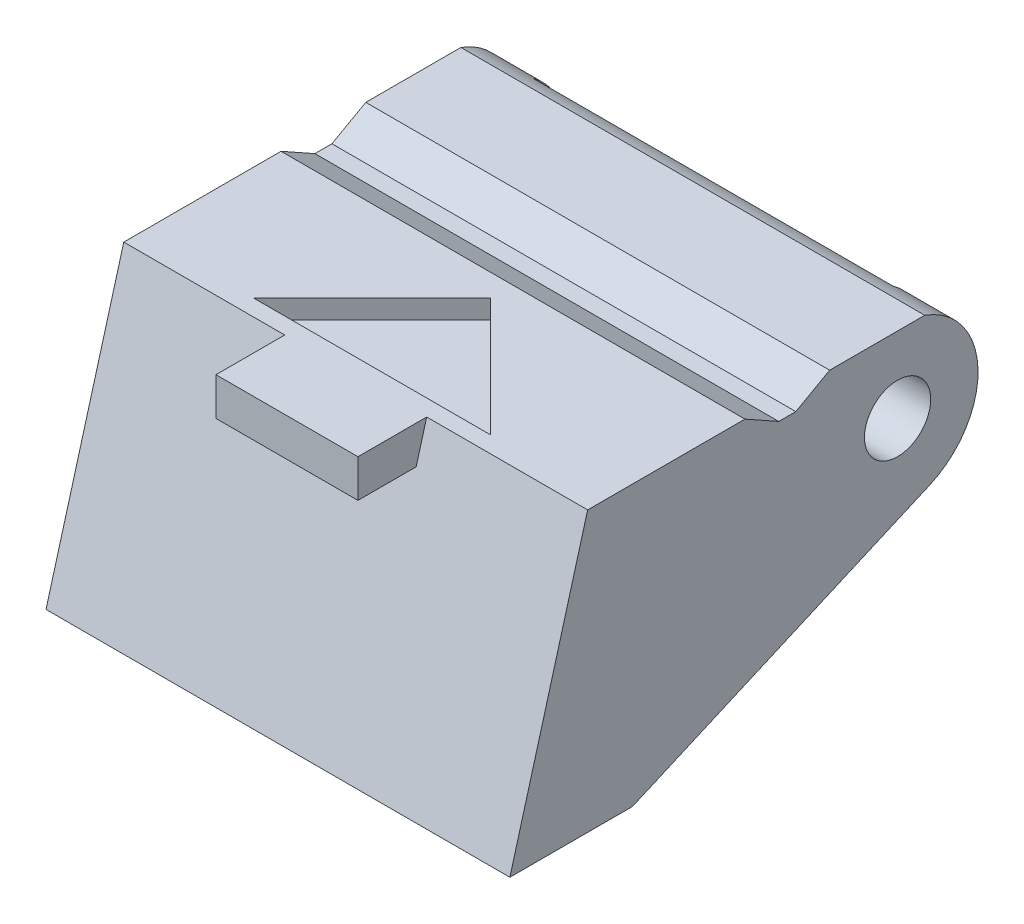
ISO-10303-21;
HEADER;
FILE_DESCRIPTION(('STEP AP214'),'2;1');
FILE_NAME('part.step','',(''),(''),'','','');
FILE_SCHEMA(('AUTOMOTIVE_DESIGN { 1 0 10303 214 1 1 1 1 }'));
ENDSEC;
DATA;
#1=APPLICATION_CONTEXT('core data for automotive mechanical design processes');
#2=APPLICATION_PROTOCOL_DEFINITION('international standard','automotive_design',2000,#1);
#3=PRODUCT_CONTEXT('',#1,'mechanical');
#4=PRODUCT('Part','Part','',(#3));
#5=PRODUCT_RELATED_PRODUCT_CATEGORY('part','',(#4));
#6=PRODUCT_DEFINITION_FORMATION('','',#4);
#7=PRODUCT_DEFINITION_CONTEXT('part definition',#1,'design');
#8=PRODUCT_DEFINITION('design','',#6,#7);
#9=PRODUCT_DEFINITION_SHAPE('','',#8);
#10=(LENGTH_UNIT() NAMED_UNIT(*) SI_UNIT(.MILLI.,.METRE.));
#11=(NAMED_UNIT(*) PLANE_ANGLE_UNIT() SI_UNIT($,.RADIAN.));
#12=(NAMED_UNIT(*) SI_UNIT($,.STERADIAN.) SOLID_ANGLE_UNIT());
#13=UNCERTAINTY_MEASURE_WITH_UNIT(LENGTH_MEASURE(1.E-05),#10,'distance_accuracy_value','');
#14=(GEOMETRIC_REPRESENTATION_CONTEXT(3) GLOBAL_UNCERTAINTY_ASSIGNED_CONTEXT((#13)) GLOBAL_UNIT_ASSIGNED_CONTEXT((#10,
#11,#12)) REPRESENTATION_CONTEXT('',''));
#15=CARTESIAN_POINT('',(0.,0.,0.));
#16=DIRECTION('',(0.,0.,1.));
#17=DIRECTION('',(1.,0.,0.));
#18=AXIS2_PLACEMENT_3D('',#15,#16,#17);
#19=CARTESIAN_POINT('',(4.9,1.6,-1.7));
#20=DIRECTION('',(0.,-1.,0.));
#21=DIRECTION('',(0.,0.,-1.));
#22=AXIS2_PLACEMENT_3D('',#19,#20,#21);
#23=PLANE('',#22);
#24=DIRECTION('',(0.,0.,1.));
#25=VECTOR('',#24,1.);
#26=CARTESIAN_POINT('',(-4.9,1.6,-1.7));
#27=LINE('',#26,#25);
#28=CARTESIAN_POINT('',(-4.9,1.6,-0.574456264653803));
#29=VERTEX_POINT('',#28);
#30=CARTESIAN_POINT('',(-4.9,1.6,1.435));
#31=VERTEX_POINT('',#30);
#32=EDGE_CURVE('E187',#29,#31,#27,.T.);
#33=ORIENTED_EDGE('',*,*,#32,.T.);
#34=DIRECTION('',(1.,0.,0.));
#35=VECTOR('',#34,1.);
#36=CARTESIAN_POINT('',(-5.,1.6,1.435));
#37=LINE('',#36,#35);
#38=CARTESIAN_POINT('',(4.9,1.6,1.435));
#39=VERTEX_POINT('',#38);
#40=EDGE_CURVE('E292',#31,#39,#37,.T.);
#41=ORIENTED_EDGE('',*,*,#40,.T.);
#42=DIRECTION('',(0.,0.,1.));
#43=VECTOR('',#42,1.);
#44=CARTESIAN_POINT('',(4.9,1.6,-1.7));
#45=LINE('',#44,#43);
#46=CARTESIAN_POINT('',(4.9,1.6,-0.574456264653803));
#47=VERTEX_POINT('',#46);
#48=EDGE_CURVE('E277',#47,#39,#45,.T.);
#49=ORIENTED_EDGE('',*,*,#48,.F.);
#50=DIRECTION('',(-1.,0.,0.));
#51=VECTOR('',#50,1.);
#52=CARTESIAN_POINT('',(4.9,1.6,-0.574456264653803));
#53=LINE('',#52,#51);
#54=EDGE_CURVE('E264',#47,#29,#53,.T.);
#55=ORIENTED_EDGE('',*,*,#54,.T.);
#56=EDGE_LOOP('',(#33,#41,#49,#55));
#57=FACE_BOUND('',#56,.T.);
#58=ADVANCED_FACE('F15',(#57),#23,.F.);
#59=CARTESIAN_POINT('',(4.9,0.,0.));
#60=DIRECTION('',(-1.,0.,0.));
#61=DIRECTION('',(0.,0.,1.));
#62=AXIS2_PLACEMENT_3D('',#59,#60,#61);
#63=CYLINDRICAL_SURFACE('',#62,1.7);
#64=CARTESIAN_POINT('',(3.8,0.,0.));
#65=DIRECTION('',(1.,0.,0.));
#66=DIRECTION('',(0.,0.,-1.));
#67=AXIS2_PLACEMENT_3D('',#64,#65,#66);
#68=CIRCLE('',#67,1.7);
#69=CARTESIAN_POINT('',(3.8,-1.55797498876303,-0.680230794943039));
#70=VERTEX_POINT('',#69);
#71=CARTESIAN_POINT('',(3.8,1.38081445189058,-0.991640786499881));
#72=VERTEX_POINT('',#71);
#73=EDGE_CURVE('E254',#70,#72,#68,.T.);
#74=ORIENTED_EDGE('',*,*,#73,.T.);
#75=DIRECTION('',(-1.,0.,0.));
#76=VECTOR('',#75,1.);
#77=CARTESIAN_POINT('',(3.8,1.38081445189058,-0.991640786499881));
#78=LINE('',#77,#76);
#79=CARTESIAN_POINT('',(-3.8,1.38081445189058,-0.991640786499881));
#80=VERTEX_POINT('',#79);
#81=EDGE_CURVE('E231',#72,#80,#78,.T.);
#82=ORIENTED_EDGE('',*,*,#81,.T.);
#83=CARTESIAN_POINT('',(-3.8,0.,0.));
#84=DIRECTION('',(1.,0.,0.));
#85=DIRECTION('',(0.,0.,-1.));
#86=AXIS2_PLACEMENT_3D('',#83,#84,#85);
#87=CIRCLE('',#86,1.7);
#88=CARTESIAN_POINT('',(-3.8,-1.55797498876303,-0.680230794943039));
#89=VERTEX_POINT('',#88);
#90=EDGE_CURVE('E337',#89,#80,#87,.T.);
#91=ORIENTED_EDGE('',*,*,#90,.F.);
#92=DIRECTION('',(1.,0.,0.));
#93=VECTOR('',#92,1.);
#94=CARTESIAN_POINT('',(-4.9,-1.55797498876303,-0.680230794943039));
#95=LINE('',#94,#93);
#96=CARTESIAN_POINT('',(-4.9,-1.55797498876303,-0.680230794943039));
#97=VERTEX_POINT('',#96);
#98=EDGE_CURVE('E188',#97,#89,#95,.T.);
#99=ORIENTED_EDGE('',*,*,#98,.F.);
#100=CARTESIAN_POINT('',(-4.9,0.,0.));
#101=DIRECTION('',(-1.,0.,0.));
#102=DIRECTION('',(0.,0.,-1.));
#103=AXIS2_PLACEMENT_3D('',#100,#101,#102);
#104=CIRCLE('',#103,1.7);
#105=EDGE_CURVE('E346',#29,#97,#104,.T.);
#106=ORIENTED_EDGE('',*,*,#105,.F.);
#107=ORIENTED_EDGE('',*,*,#54,.F.);
#108=CARTESIAN_POINT('',(4.9,0.,0.));
#109=DIRECTION('',(-1.,0.,0.));
#110=DIRECTION('',(0.,0.,-1.));
#111=AXIS2_PLACEMENT_3D('',#108,#109,#110);
#112=CIRCLE('',#111,1.7);
#113=CARTESIAN_POINT('',(4.9,-1.55797498876303,-0.680230794943039));
#114=VERTEX_POINT('',#113);
#115=EDGE_CURVE('E266',#47,#114,#112,.T.);
#116=ORIENTED_EDGE('',*,*,#115,.T.);
#117=DIRECTION('',(-1.,0.,0.));
#118=VECTOR('',#117,1.);
#119=CARTESIAN_POINT('',(4.9,-1.55797498876303,-0.680230794943039));
#120=LINE('',#119,#118);
#121=EDGE_CURVE('E274',#114,#70,#120,.T.);
#122=ORIENTED_EDGE('',*,*,#121,.T.);
#123=EDGE_LOOP('',(#74,#82,#91,#99,#106,#107,#116,#122));
#124=FACE_BOUND('',#123,.T.);
#125=ADVANCED_FACE('F386',(#124),#63,.T.);
#126=CARTESIAN_POINT('',(3.8,0.799999999999999,5.94));
#127=DIRECTION('',(0.,-1.,0.));
#128=DIRECTION('',(0.,0.,-1.));
#129=AXIS2_PLACEMENT_3D('',#126,#127,#128);
#130=PLANE('',#129);
#131=DIRECTION('',(-1.,0.,0.));
#132=VECTOR('',#131,1.);
#133=CARTESIAN_POINT('',(3.8,0.799999999999999,5.94));
#134=LINE('',#133,#132);
#135=CARTESIAN_POINT('',(3.8,0.799999999999999,5.94));
#136=VERTEX_POINT('',#135);
#137=CARTESIAN_POINT('',(-3.8,0.799999999999999,5.94));
#138=VERTEX_POINT('',#137);
#139=EDGE_CURVE('E262',#136,#138,#134,.T.);
#140=ORIENTED_EDGE('',*,*,#139,.T.);
#141=DIRECTION('',(0.,0.,1.));
#142=VECTOR('',#141,1.);
#143=CARTESIAN_POINT('',(-3.8,0.799999999999999,5.94));
#144=LINE('',#143,#142);
#145=CARTESIAN_POINT('',(-3.8,0.799999999999999,0.0143593539448927));
#146=VERTEX_POINT('',#145);
#147=EDGE_CURVE('E340',#146,#138,#144,.T.);
#148=ORIENTED_EDGE('',*,*,#147,.F.);
#149=DIRECTION('',(-1.,0.,0.));
#150=VECTOR('',#149,1.);
#151=CARTESIAN_POINT('',(3.8,0.799999999999999,0.0143593539448927));
#152=LINE('',#151,#150);
#153=CARTESIAN_POINT('',(3.8,0.799999999999999,0.0143593539448927));
#154=VERTEX_POINT('',#153);
#155=EDGE_CURVE('E229',#154,#146,#152,.T.);
#156=ORIENTED_EDGE('',*,*,#155,.F.);
#157=DIRECTION('',(0.,0.,1.));
#158=VECTOR('',#157,1.);
#159=CARTESIAN_POINT('',(3.8,0.799999999999999,5.94));
#160=LINE('',#159,#158);
#161=EDGE_CURVE('E256',#154,#136,#160,.T.);
#162=ORIENTED_EDGE('',*,*,#161,.T.);
#163=EDGE_LOOP('',(#140,#148,#156,#162));
#164=FACE_BOUND('',#163,.T.);
#165=ADVANCED_FACE('F392',(#164),#130,.T.);
#166=CARTESIAN_POINT('',(4.9,1.6,-1.7));
#167=DIRECTION('',(-1.,0.,0.));
#168=DIRECTION('',(0.,0.,1.));
#169=AXIS2_PLACEMENT_3D('',#166,#167,#168);
#170=PLANE('',#169);
#171=ORIENTED_EDGE('',*,*,#48,.T.);
#172=DIRECTION('',(0.,-0.488231650079598,0.872714074517281));
#173=VECTOR('',#172,1.);
#174=CARTESIAN_POINT('',(4.9,2.93578159335544,-0.952709598122836));
#175=LINE('',#174,#173);
#176=CARTESIAN_POINT('',(4.9,1.2,2.15));
#177=VERTEX_POINT('',#176);
#178=EDGE_CURVE('E301',#39,#177,#175,.T.);
#179=ORIENTED_EDGE('',*,*,#178,.T.);
#180=DIRECTION('',(0.,0.,1.));
#181=VECTOR('',#180,1.);
#182=CARTESIAN_POINT('',(4.9,1.2,-1.7));
#183=LINE('',#182,#181);
#184=CARTESIAN_POINT('',(4.9,1.2,2.51));
#185=VERTEX_POINT('',#184);
#186=EDGE_CURVE('E289',#177,#185,#183,.T.);
#187=ORIENTED_EDGE('',*,*,#186,.T.);
#188=DIRECTION('',(0.,0.488231650079598,0.872714074517281));
#189=VECTOR('',#188,1.);
#190=CARTESIAN_POINT('',(4.9,-0.498476665797609,-0.526027040113224));
#191=LINE('',#190,#189);
#192=CARTESIAN_POINT('',(4.9,1.6,3.225));
#193=VERTEX_POINT('',#192);
#194=EDGE_CURVE('E295',#185,#193,#191,.T.);
#195=ORIENTED_EDGE('',*,*,#194,.T.);
#196=CARTESIAN_POINT('',(4.9,1.6,6.54768574116445));
#197=VERTEX_POINT('',#196);
#198=EDGE_CURVE('E179',#193,#197,#45,.T.);
#199=ORIENTED_EDGE('',*,*,#198,.T.);
#200=DIRECTION('',(0.,0.963355359932388,-0.268228355118429));
#201=VECTOR('',#200,1.);
#202=CARTESIAN_POINT('',(4.9,0.799999999999999,6.77043083920366));
#203=LINE('',#202,#201);
#204=CARTESIAN_POINT('',(4.9,-4.3,8.19043083920366));
#205=VERTEX_POINT('',#204);
#206=EDGE_CURVE('E241',#205,#197,#203,.T.);
#207=ORIENTED_EDGE('',*,*,#206,.F.);
#208=DIRECTION('',(0.,0.,-1.));
#209=VECTOR('',#208,1.);
#210=CARTESIAN_POINT('',(4.9,-4.3,-1.7));
#211=LINE('',#210,#209);
#212=CARTESIAN_POINT('',(4.9,-4.3,5.6));
#213=VERTEX_POINT('',#212);
#214=EDGE_CURVE('E171',#205,#213,#211,.T.);
#215=ORIENTED_EDGE('',*,*,#214,.T.);
#216=DIRECTION('',(0.,-0.4001357617312,0.916455875742958));
#217=VECTOR('',#216,1.);
#218=CARTESIAN_POINT('',(4.9,-4.3,5.6));
#219=LINE('',#218,#217);
#220=EDGE_CURVE('E268',#114,#213,#219,.T.);
#221=ORIENTED_EDGE('',*,*,#220,.F.);
#222=ORIENTED_EDGE('',*,*,#115,.F.);
#223=EDGE_LOOP('',(#171,#179,#187,#195,#199,#207,#215,#221,#222));
#224=FACE_BOUND('',#223,.T.);
#225=CARTESIAN_POINT('',(4.9,0.,0.));
#226=DIRECTION('',(1.,0.,0.));
#227=DIRECTION('',(0.,0.,-1.));
#228=AXIS2_PLACEMENT_3D('',#225,#226,#227);
#229=CIRCLE('',#228,0.7);
#230=CARTESIAN_POINT('',(4.9,0.,-0.7));
#231=VERTEX_POINT('',#230);
#232=EDGE_CURVE('E233',#231,#231,#229,.T.);
#233=ORIENTED_EDGE('',*,*,#232,.F.);
#234=EDGE_LOOP('',(#233));
#235=FACE_BOUND('',#234,.T.);
#236=ADVANCED_FACE('F378',(#224,#235),#170,.F.);
#237=CARTESIAN_POINT('',(3.8,0.,0.));
#238=DIRECTION('',(1.,0.,0.));
#239=DIRECTION('',(0.,0.,-1.));
#240=AXIS2_PLACEMENT_3D('',#237,#238,#239);
#241=PLANE('',#240);
#242=DIRECTION('',(0.,0.,-1.));
#243=VECTOR('',#242,1.);
#244=CARTESIAN_POINT('',(3.8,-4.3,7.36));
#245=LINE('',#244,#243);
#246=CARTESIAN_POINT('',(3.8,-4.3,7.36));
#247=VERTEX_POINT('',#246);
#248=CARTESIAN_POINT('',(3.8,-4.3,5.6));
#249=VERTEX_POINT('',#248);
#250=EDGE_CURVE('E248',#247,#249,#245,.T.);
#251=ORIENTED_EDGE('',*,*,#250,.F.);
#252=DIRECTION('',(0.,-0.963355359932388,0.268228355118429));
#253=VECTOR('',#252,1.);
#254=CARTESIAN_POINT('',(3.8,-4.3,7.36));
#255=LINE('',#254,#253);
#256=EDGE_CURVE('E258',#136,#247,#255,.T.);
#257=ORIENTED_EDGE('',*,*,#256,.F.);
#258=ORIENTED_EDGE('',*,*,#161,.F.);
#259=DIRECTION('',(0.,-0.499999999999995,0.866025403784441));
#260=VECTOR('',#259,1.);
#261=CARTESIAN_POINT('',(3.8,0.799999999999999,0.0143593539448927));
#262=LINE('',#261,#260);
#263=EDGE_CURVE('E227',#72,#154,#262,.T.);
#264=ORIENTED_EDGE('',*,*,#263,.F.);
#265=ORIENTED_EDGE('',*,*,#73,.F.);
#266=DIRECTION('',(0.,0.4001357617312,-0.916455875742958));
#267=VECTOR('',#266,1.);
#268=CARTESIAN_POINT('',(3.8,-1.55797498876303,-0.680230794943039));
#269=LINE('',#268,#267);
#270=EDGE_CURVE('E251',#249,#70,#269,.T.);
#271=ORIENTED_EDGE('',*,*,#270,.F.);
#272=EDGE_LOOP('',(#251,#257,#258,#264,#265,#271));
#273=FACE_BOUND('',#272,.T.);
#274=CARTESIAN_POINT('',(3.8,0.,0.));
#275=DIRECTION('',(1.,0.,0.));
#276=DIRECTION('',(0.,0.,-1.));
#277=AXIS2_PLACEMENT_3D('',#274,#275,#276);
#278=CIRCLE('',#277,0.7);
#279=CARTESIAN_POINT('',(3.8,0.,-0.7));
#280=VERTEX_POINT('',#279);
#281=EDGE_CURVE('E236',#280,#280,#278,.F.);
#282=ORIENTED_EDGE('',*,*,#281,.F.);
#283=EDGE_LOOP('',(#282));
#284=FACE_BOUND('',#283,.T.);
#285=ADVANCED_FACE('F395',(#273,#284),#241,.F.);
#286=DIRECTION('',(0.707106781186548,0.,-0.707106781186548));
#287=VECTOR('',#286,1.);
#288=CARTESIAN_POINT('',(0.,1.6,3.7));
#289=LINE('',#288,#287);
#290=CARTESIAN_POINT('',(-2.5,1.6,6.2));
#291=VERTEX_POINT('',#290);
#292=CARTESIAN_POINT('',(0.,1.6,3.7));
#293=VERTEX_POINT('',#292);
#294=EDGE_CURVE('E303',#291,#293,#289,.T.);
#295=ORIENTED_EDGE('',*,*,#294,.T.);
#296=DIRECTION('',(-0.707106781186548,0.,-0.707106781186548));
#297=VECTOR('',#296,1.);
#298=CARTESIAN_POINT('',(0.,1.6,3.7));
#299=LINE('',#298,#297);
#300=CARTESIAN_POINT('',(2.5,1.6,6.2));
#301=VERTEX_POINT('',#300);
#302=EDGE_CURVE('E199',#301,#293,#299,.T.);
#303=ORIENTED_EDGE('',*,*,#302,.F.);
#304=DIRECTION('',(1.,0.,0.));
#305=VECTOR('',#304,1.);
#306=CARTESIAN_POINT('',(2.5,1.6,6.2));
#307=LINE('',#306,#305);
#308=EDGE_CURVE('E206',#291,#301,#307,.T.);
#309=ORIENTED_EDGE('',*,*,#308,.F.);
#310=EDGE_LOOP('',(#295,#303,#309));
#311=FACE_BOUND('',#310,.T.);
#312=ORIENTED_EDGE('',*,*,#198,.F.);
#313=DIRECTION('',(1.,0.,0.));
#314=VECTOR('',#313,1.);
#315=CARTESIAN_POINT('',(-5.,1.6,3.225));
#316=LINE('',#315,#314);
#317=CARTESIAN_POINT('',(-4.9,1.6,3.225));
#318=VERTEX_POINT('',#317);
#319=EDGE_CURVE('E166',#318,#193,#316,.T.);
#320=ORIENTED_EDGE('',*,*,#319,.F.);
#321=CARTESIAN_POINT('',(-4.9,1.6,6.54768574116444));
#322=VERTEX_POINT('',#321);
#323=EDGE_CURVE('E176',#318,#322,#27,.T.);
#324=ORIENTED_EDGE('',*,*,#323,.T.);
#325=DIRECTION('',(-1.,0.,0.));
#326=VECTOR('',#325,1.);
#327=CARTESIAN_POINT('',(-1.5,1.6,6.54768574116445));
#328=LINE('',#327,#326);
#329=CARTESIAN_POINT('',(-1.5,1.6,6.54768574116445));
#330=VERTEX_POINT('',#329);
#331=EDGE_CURVE('E324',#330,#322,#328,.T.);
#332=ORIENTED_EDGE('',*,*,#331,.F.);
#333=DIRECTION('',(0.,0.,1.));
#334=VECTOR('',#333,1.);
#335=CARTESIAN_POINT('',(-1.5,1.6,6.54768574116445));
#336=LINE('',#335,#334);
#337=CARTESIAN_POINT('',(-1.5,1.6,8.));
#338=VERTEX_POINT('',#337);
#339=EDGE_CURVE('E318',#330,#338,#336,.T.);
#340=ORIENTED_EDGE('',*,*,#339,.T.);
#341=DIRECTION('',(-1.,0.,0.));
#342=VECTOR('',#341,1.);
#343=CARTESIAN_POINT('',(4.9,1.6,8.));
#344=LINE('',#343,#342);
#345=CARTESIAN_POINT('',(1.5,1.6,8.));
#346=VERTEX_POINT('',#345);
#347=EDGE_CURVE('E237',#346,#338,#344,.T.);
#348=ORIENTED_EDGE('',*,*,#347,.F.);
#349=DIRECTION('',(0.,0.,1.));
#350=VECTOR('',#349,1.);
#351=CARTESIAN_POINT('',(1.5,1.6,6.54768574116445));
#352=LINE('',#351,#350);
#353=CARTESIAN_POINT('',(1.5,1.6,6.54768574116445));
#354=VERTEX_POINT('',#353);
#355=EDGE_CURVE('E38',#354,#346,#352,.T.);
#356=ORIENTED_EDGE('',*,*,#355,.F.);
#357=DIRECTION('',(1.,0.,0.));
#358=VECTOR('',#357,1.);
#359=CARTESIAN_POINT('',(1.5,1.6,6.54768574116445));
#360=LINE('',#359,#358);
#361=EDGE_CURVE('E225',#354,#197,#360,.T.);
#362=ORIENTED_EDGE('',*,*,#361,.T.);
#363=EDGE_LOOP('',(#312,#320,#324,#332,#340,#348,#356,#362));
#364=FACE_BOUND('',#363,.T.);
#365=ADVANCED_FACE('F17',(#311,#364),#23,.F.);
#366=CARTESIAN_POINT('',(4.9,0.799999999999999,6.77043083920366));
#367=DIRECTION('',(0.,-1.,0.));
#368=DIRECTION('',(0.,0.,-1.));
#369=AXIS2_PLACEMENT_3D('',#366,#367,#368);
#370=PLANE('',#369);
#371=DIRECTION('',(0.,0.,-1.));
#372=VECTOR('',#371,1.);
#373=CARTESIAN_POINT('',(1.5,0.799999999999999,6.77043083920366));
#374=LINE('',#373,#372);
#375=CARTESIAN_POINT('',(1.5,0.799999999999999,8.));
#376=VERTEX_POINT('',#375);
#377=CARTESIAN_POINT('',(1.5,0.799999999999999,6.77043083920366));
#378=VERTEX_POINT('',#377);
#379=EDGE_CURVE('E217',#376,#378,#374,.T.);
#380=ORIENTED_EDGE('',*,*,#379,.F.);
#381=DIRECTION('',(-1.,0.,0.));
#382=VECTOR('',#381,1.);
#383=CARTESIAN_POINT('',(4.9,0.799999999999999,8.));
#384=LINE('',#383,#382);
#385=CARTESIAN_POINT('',(-1.5,0.799999999999999,8.));
#386=VERTEX_POINT('',#385);
#387=EDGE_CURVE('E239',#376,#386,#384,.T.);
#388=ORIENTED_EDGE('',*,*,#387,.T.);
#389=DIRECTION('',(0.,0.,-1.));
#390=VECTOR('',#389,1.);
#391=CARTESIAN_POINT('',(-1.5,0.799999999999999,6.77043083920366));
#392=LINE('',#391,#390);
#393=CARTESIAN_POINT('',(-1.5,0.799999999999999,6.77043083920366));
#394=VERTEX_POINT('',#393);
#395=EDGE_CURVE('E311',#386,#394,#392,.T.);
#396=ORIENTED_EDGE('',*,*,#395,.T.);
#397=DIRECTION('',(-1.,0.,0.));
#398=VECTOR('',#397,1.);
#399=CARTESIAN_POINT('',(4.9,0.799999999999999,6.77043083920366));
#400=LINE('',#399,#398);
#401=EDGE_CURVE('E244',#378,#394,#400,.T.);
#402=ORIENTED_EDGE('',*,*,#401,.F.);
#403=EDGE_LOOP('',(#380,#388,#396,#402));
#404=FACE_BOUND('',#403,.T.);
#405=ADVANCED_FACE('F419',(#404),#370,.T.);
#406=CARTESIAN_POINT('',(4.9,-4.3,-1.7));
#407=DIRECTION('',(0.,1.,0.));
#408=DIRECTION('',(0.,0.,1.));
#409=AXIS2_PLACEMENT_3D('',#406,#407,#408);
#410=PLANE('',#409);
#411=DIRECTION('',(-1.,0.,0.));
#412=VECTOR('',#411,1.);
#413=CARTESIAN_POINT('',(4.9,-4.3,8.19043083920366));
#414=LINE('',#413,#412);
#415=CARTESIAN_POINT('',(-4.9,-4.3,8.19043083920366));
#416=VERTEX_POINT('',#415);
#417=EDGE_CURVE('E246',#205,#416,#414,.T.);
#418=ORIENTED_EDGE('',*,*,#417,.T.);
#419=DIRECTION('',(0.,0.,-1.));
#420=VECTOR('',#419,1.);
#421=CARTESIAN_POINT('',(-4.9,-4.3,-1.7));
#422=LINE('',#421,#420);
#423=CARTESIAN_POINT('',(-4.9,-4.3,5.6));
#424=VERTEX_POINT('',#423);
#425=EDGE_CURVE('E191',#416,#424,#422,.T.);
#426=ORIENTED_EDGE('',*,*,#425,.T.);
#427=DIRECTION('',(1.,0.,0.));
#428=VECTOR('',#427,1.);
#429=CARTESIAN_POINT('',(-4.9,-4.3,5.6));
#430=LINE('',#429,#428);
#431=CARTESIAN_POINT('',(-3.8,-4.3,5.6));
#432=VERTEX_POINT('',#431);
#433=EDGE_CURVE('E193',#424,#432,#430,.T.);
#434=ORIENTED_EDGE('',*,*,#433,.T.);
#435=DIRECTION('',(0.,0.,-1.));
#436=VECTOR('',#435,1.);
#437=CARTESIAN_POINT('',(-3.8,-4.3,7.36));
#438=LINE('',#437,#436);
#439=CARTESIAN_POINT('',(-3.8,-4.3,7.36));
#440=VERTEX_POINT('',#439);
#441=EDGE_CURVE('E332',#440,#432,#438,.T.);
#442=ORIENTED_EDGE('',*,*,#441,.F.);
#443=DIRECTION('',(-1.,0.,0.));
#444=VECTOR('',#443,1.);
#445=CARTESIAN_POINT('',(3.8,-4.3,7.36));
#446=LINE('',#445,#444);
#447=EDGE_CURVE('E260',#247,#440,#446,.T.);
#448=ORIENTED_EDGE('',*,*,#447,.F.);
#449=ORIENTED_EDGE('',*,*,#250,.T.);
#450=DIRECTION('',(-1.,0.,0.));
#451=VECTOR('',#450,1.);
#452=CARTESIAN_POINT('',(4.9,-4.3,5.6));
#453=LINE('',#452,#451);
#454=EDGE_CURVE('E271',#213,#249,#453,.T.);
#455=ORIENTED_EDGE('',*,*,#454,.F.);
#456=ORIENTED_EDGE('',*,*,#214,.F.);
#457=EDGE_LOOP('',(#418,#426,#434,#442,#448,#449,#455,#456));
#458=FACE_BOUND('',#457,.T.);
#459=ADVANCED_FACE('F354',(#458),#410,.F.);
#460=CARTESIAN_POINT('',(4.9,-4.3,5.6));
#461=DIRECTION('',(0.,-0.916455875742958,-0.4001357617312));
#462=DIRECTION('',(0.,0.4001357617312,-0.916455875742958));
#463=AXIS2_PLACEMENT_3D('',#460,#461,#462);
#464=PLANE('',#463);
#465=ORIENTED_EDGE('',*,*,#270,.T.);
#466=ORIENTED_EDGE('',*,*,#121,.F.);
#467=ORIENTED_EDGE('',*,*,#220,.T.);
#468=ORIENTED_EDGE('',*,*,#454,.T.);
#469=EDGE_LOOP('',(#465,#466,#467,#468));
#470=FACE_BOUND('',#469,.T.);
#471=ADVANCED_FACE('F374',(#470),#464,.T.);
#472=CARTESIAN_POINT('',(3.8,-4.3,7.36));
#473=DIRECTION('',(0.,-0.268228355118429,-0.963355359932388));
#474=DIRECTION('',(0.,0.963355359932389,-0.268228355118429));
#475=AXIS2_PLACEMENT_3D('',#472,#473,#474);
#476=PLANE('',#475);
#477=ORIENTED_EDGE('',*,*,#447,.T.);
#478=DIRECTION('',(0.,-0.963355359932388,0.268228355118429));
#479=VECTOR('',#478,1.);
#480=CARTESIAN_POINT('',(-3.8,-4.3,7.36));
#481=LINE('',#480,#479);
#482=EDGE_CURVE('E343',#138,#440,#481,.T.);
#483=ORIENTED_EDGE('',*,*,#482,.F.);
#484=ORIENTED_EDGE('',*,*,#139,.F.);
#485=ORIENTED_EDGE('',*,*,#256,.T.);
#486=EDGE_LOOP('',(#477,#483,#484,#485));
#487=FACE_BOUND('',#486,.T.);
#488=ADVANCED_FACE('F367',(#487),#476,.T.);
#489=CARTESIAN_POINT('',(4.9,0.799999999999999,6.77043083920366));
#490=DIRECTION('',(0.,0.268228355118429,0.963355359932388));
#491=DIRECTION('',(0.,-0.963355359932389,0.268228355118429));
#492=AXIS2_PLACEMENT_3D('',#489,#490,#491);
#493=PLANE('',#492);
#494=ORIENTED_EDGE('',*,*,#401,.T.);
#495=DIRECTION('',(0.,0.963355359932388,-0.268228355118431));
#496=VECTOR('',#495,1.);
#497=CARTESIAN_POINT('',(-1.5,1.6,6.54768574116445));
#498=LINE('',#497,#496);
#499=EDGE_CURVE('E316',#394,#330,#498,.T.);
#500=ORIENTED_EDGE('',*,*,#499,.T.);
#501=ORIENTED_EDGE('',*,*,#331,.T.);
#502=DIRECTION('',(0.,0.963355359932388,-0.268228355118429));
#503=VECTOR('',#502,1.);
#504=CARTESIAN_POINT('',(-4.9,0.799999999999999,6.77043083920366));
#505=LINE('',#504,#503);
#506=EDGE_CURVE('E186',#416,#322,#505,.T.);
#507=ORIENTED_EDGE('',*,*,#506,.F.);
#508=ORIENTED_EDGE('',*,*,#417,.F.);
#509=ORIENTED_EDGE('',*,*,#206,.T.);
#510=ORIENTED_EDGE('',*,*,#361,.F.);
#511=DIRECTION('',(0.,0.963355359932388,-0.268228355118431));
#512=VECTOR('',#511,1.);
#513=CARTESIAN_POINT('',(1.5,1.6,6.54768574116445));
#514=LINE('',#513,#512);
#515=EDGE_CURVE('E220',#378,#354,#514,.T.);
#516=ORIENTED_EDGE('',*,*,#515,.F.);
#517=EDGE_LOOP('',(#494,#500,#501,#507,#508,#509,#510,#516));
#518=FACE_BOUND('',#517,.T.);
#519=ADVANCED_FACE('F383',(#518),#493,.T.);
#520=CARTESIAN_POINT('',(4.9,1.6,8.));
#521=DIRECTION('',(0.,0.,1.));
#522=DIRECTION('',(1.,0.,0.));
#523=AXIS2_PLACEMENT_3D('',#520,#521,#522);
#524=PLANE('',#523);
#525=DIRECTION('',(0.,-1.,0.));
#526=VECTOR('',#525,1.);
#527=CARTESIAN_POINT('',(1.5,0.799999999999999,8.));
#528=LINE('',#527,#526);
#529=EDGE_CURVE('E223',#346,#376,#528,.T.);
#530=ORIENTED_EDGE('',*,*,#529,.F.);
#531=ORIENTED_EDGE('',*,*,#347,.T.);
#532=DIRECTION('',(0.,-1.,0.));
#533=VECTOR('',#532,1.);
#534=CARTESIAN_POINT('',(-1.5,0.799999999999999,8.));
#535=LINE('',#534,#533);
#536=EDGE_CURVE('E321',#338,#386,#535,.T.);
#537=ORIENTED_EDGE('',*,*,#536,.T.);
#538=ORIENTED_EDGE('',*,*,#387,.F.);
#539=EDGE_LOOP('',(#530,#531,#537,#538));
#540=FACE_BOUND('',#539,.T.);
#541=ADVANCED_FACE('F409',(#540),#524,.T.);
#542=CARTESIAN_POINT('',(4.9,0.,0.));
#543=DIRECTION('',(-1.,0.,0.));
#544=DIRECTION('',(0.,0.,1.));
#545=AXIS2_PLACEMENT_3D('',#542,#543,#544);
#546=CYLINDRICAL_SURFACE('',#545,0.7);
#547=ORIENTED_EDGE('',*,*,#232,.T.);
#548=EDGE_LOOP('',(#547));
#549=FACE_BOUND('',#548,.T.);
#550=ORIENTED_EDGE('',*,*,#281,.T.);
#551=EDGE_LOOP('',(#550));
#552=FACE_BOUND('',#551,.T.);
#553=ADVANCED_FACE('F400',(#549,#552),#546,.F.);
#554=CARTESIAN_POINT('',(3.8,0.799999999999999,0.0143593539448927));
#555=DIRECTION('',(0.,-0.866025403784441,-0.499999999999995));
#556=DIRECTION('',(0.,0.499999999999995,-0.866025403784441));
#557=AXIS2_PLACEMENT_3D('',#554,#555,#556);
#558=PLANE('',#557);
#559=ORIENTED_EDGE('',*,*,#155,.T.);
#560=DIRECTION('',(0.,-0.499999999999995,0.866025403784441));
#561=VECTOR('',#560,1.);
#562=CARTESIAN_POINT('',(-3.8,0.799999999999999,0.0143593539448927));
#563=LINE('',#562,#561);
#564=EDGE_CURVE('E326',#80,#146,#563,.T.);
#565=ORIENTED_EDGE('',*,*,#564,.F.);
#566=ORIENTED_EDGE('',*,*,#81,.F.);
#567=ORIENTED_EDGE('',*,*,#263,.T.);
#568=EDGE_LOOP('',(#559,#565,#566,#567));
#569=FACE_BOUND('',#568,.T.);
#570=ADVANCED_FACE('F397',(#569),#558,.T.);
#571=CARTESIAN_POINT('',(1.5,0.799999999999999,8.));
#572=DIRECTION('',(-1.,0.,0.));
#573=DIRECTION('',(0.,0.,1.));
#574=AXIS2_PLACEMENT_3D('',#571,#572,#573);
#575=PLANE('',#574);
#576=ORIENTED_EDGE('',*,*,#379,.T.);
#577=ORIENTED_EDGE('',*,*,#515,.T.);
#578=ORIENTED_EDGE('',*,*,#355,.T.);
#579=ORIENTED_EDGE('',*,*,#529,.T.);
#580=EDGE_LOOP('',(#576,#577,#578,#579));
#581=FACE_BOUND('',#580,.T.);
#582=ADVANCED_FACE('F399',(#581),#575,.F.);
#583=CARTESIAN_POINT('',(0.,1.2,3.7));
#584=DIRECTION('',(0.707106781186548,0.,-0.707106781186548));
#585=DIRECTION('',(-0.707106781186548,0.,-0.707106781186548));
#586=AXIS2_PLACEMENT_3D('',#583,#584,#585);
#587=PLANE('',#586);
#588=ORIENTED_EDGE('',*,*,#302,.T.);
#589=DIRECTION('',(0.,1.,0.));
#590=VECTOR('',#589,1.);
#591=CARTESIAN_POINT('',(0.,1.2,3.7));
#592=LINE('',#591,#590);
#593=CARTESIAN_POINT('',(0.,1.2,3.7));
#594=VERTEX_POINT('',#593);
#595=EDGE_CURVE('E307',#594,#293,#592,.T.);
#596=ORIENTED_EDGE('',*,*,#595,.F.);
#597=DIRECTION('',(-0.707106781186548,0.,-0.707106781186548));
#598=VECTOR('',#597,1.);
#599=CARTESIAN_POINT('',(0.,1.2,3.7));
#600=LINE('',#599,#598);
#601=CARTESIAN_POINT('',(2.5,1.2,6.2));
#602=VERTEX_POINT('',#601);
#603=EDGE_CURVE('E209',#602,#594,#600,.T.);
#604=ORIENTED_EDGE('',*,*,#603,.F.);
#605=DIRECTION('',(0.,1.,0.));
#606=VECTOR('',#605,1.);
#607=CARTESIAN_POINT('',(2.5,1.2,6.2));
#608=LINE('',#607,#606);
#609=EDGE_CURVE('E215',#602,#301,#608,.T.);
#610=ORIENTED_EDGE('',*,*,#609,.T.);
#611=EDGE_LOOP('',(#588,#596,#604,#610));
#612=FACE_BOUND('',#611,.T.);
#613=ADVANCED_FACE('F407',(#612),#587,.F.);
#614=CARTESIAN_POINT('',(2.5,1.2,6.2));
#615=DIRECTION('',(0.,0.,1.));
#616=DIRECTION('',(0.,-1.,0.));
#617=AXIS2_PLACEMENT_3D('',#614,#615,#616);
#618=PLANE('',#617);
#619=ORIENTED_EDGE('',*,*,#308,.T.);
#620=ORIENTED_EDGE('',*,*,#609,.F.);
#621=DIRECTION('',(1.,0.,0.));
#622=VECTOR('',#621,1.);
#623=CARTESIAN_POINT('',(2.5,1.2,6.2));
#624=LINE('',#623,#622);
#625=CARTESIAN_POINT('',(-2.5,1.2,6.2));
#626=VERTEX_POINT('',#625);
#627=EDGE_CURVE('E212',#626,#602,#624,.T.);
#628=ORIENTED_EDGE('',*,*,#627,.F.);
#629=DIRECTION('',(0.,1.,0.));
#630=VECTOR('',#629,1.);
#631=CARTESIAN_POINT('',(-2.5,1.2,6.2));
#632=LINE('',#631,#630);
#633=EDGE_CURVE('E308',#626,#291,#632,.T.);
#634=ORIENTED_EDGE('',*,*,#633,.T.);
#635=EDGE_LOOP('',(#619,#620,#628,#634));
#636=FACE_BOUND('',#635,.T.);
#637=ADVANCED_FACE('F438',(#636),#618,.F.);
#638=CARTESIAN_POINT('',(2.5,1.2,6.2));
#639=DIRECTION('',(0.,-1.,0.));
#640=DIRECTION('',(0.,0.,-1.));
#641=AXIS2_PLACEMENT_3D('',#638,#639,#640);
#642=PLANE('',#641);
#643=ORIENTED_EDGE('',*,*,#603,.T.);
#644=DIRECTION('',(0.707106781186548,0.,-0.707106781186548));
#645=VECTOR('',#644,1.);
#646=CARTESIAN_POINT('',(0.,1.2,3.7));
#647=LINE('',#646,#645);
#648=EDGE_CURVE('E305',#626,#594,#647,.T.);
#649=ORIENTED_EDGE('',*,*,#648,.F.);
#650=ORIENTED_EDGE('',*,*,#627,.T.);
#651=EDGE_LOOP('',(#643,#649,#650));
#652=FACE_BOUND('',#651,.T.);
#653=ADVANCED_FACE('F440',(#652),#642,.F.);
#654=CARTESIAN_POINT('',(-4.9,1.6,-1.7));
#655=DIRECTION('',(1.,0.,0.));
#656=DIRECTION('',(0.,0.,1.));
#657=AXIS2_PLACEMENT_3D('',#654,#655,#656);
#658=PLANE('',#657);
#659=DIRECTION('',(0.,0.,-1.));
#660=VECTOR('',#659,1.);
#661=CARTESIAN_POINT('',(-4.9,1.2,-1.7));
#662=LINE('',#661,#660);
#663=CARTESIAN_POINT('',(-4.9,1.2,2.51));
#664=VERTEX_POINT('',#663);
#665=CARTESIAN_POINT('',(-4.9,1.2,2.15));
#666=VERTEX_POINT('',#665);
#667=EDGE_CURVE('E23',#664,#666,#662,.T.);
#668=ORIENTED_EDGE('',*,*,#667,.T.);
#669=DIRECTION('',(0.,0.488231650079598,-0.872714074517281));
#670=VECTOR('',#669,1.);
#671=CARTESIAN_POINT('',(-4.9,2.93578159335544,-0.952709598122836));
#672=LINE('',#671,#670);
#673=EDGE_CURVE('E10',#666,#31,#672,.T.);
#674=ORIENTED_EDGE('',*,*,#673,.T.);
#675=ORIENTED_EDGE('',*,*,#32,.F.);
#676=ORIENTED_EDGE('',*,*,#105,.T.);
#677=DIRECTION('',(0.,-0.4001357617312,0.916455875742958));
#678=VECTOR('',#677,1.);
#679=CARTESIAN_POINT('',(-4.9,-4.3,5.6));
#680=LINE('',#679,#678);
#681=EDGE_CURVE('E349',#97,#424,#680,.T.);
#682=ORIENTED_EDGE('',*,*,#681,.T.);
#683=ORIENTED_EDGE('',*,*,#425,.F.);
#684=ORIENTED_EDGE('',*,*,#506,.T.);
#685=ORIENTED_EDGE('',*,*,#323,.F.);
#686=DIRECTION('',(0.,-0.488231650079598,-0.872714074517281));
#687=VECTOR('',#686,1.);
#688=CARTESIAN_POINT('',(-4.9,-0.498476665797609,-0.526027040113227));
#689=LINE('',#688,#687);
#690=EDGE_CURVE('E163',#318,#664,#689,.T.);
#691=ORIENTED_EDGE('',*,*,#690,.T.);
#692=EDGE_LOOP('',(#668,#674,#675,#676,#682,#683,#684,#685,#691));
#693=FACE_BOUND('',#692,.T.);
#694=CARTESIAN_POINT('',(-4.9,0.,0.));
#695=DIRECTION('',(1.,0.,0.));
#696=DIRECTION('',(0.,0.,-1.));
#697=AXIS2_PLACEMENT_3D('',#694,#695,#696);
#698=CIRCLE('',#697,0.7);
#699=CARTESIAN_POINT('',(-4.9,0.,-0.7));
#700=VERTEX_POINT('',#699);
#701=EDGE_CURVE('E203',#700,#700,#698,.T.);
#702=ORIENTED_EDGE('',*,*,#701,.T.);
#703=EDGE_LOOP('',(#702));
#704=FACE_BOUND('',#703,.T.);
#705=ADVANCED_FACE('F182',(#693,#704),#658,.F.);
#706=CARTESIAN_POINT('',(-3.8,0.,0.));
#707=DIRECTION('',(-1.,0.,0.));
#708=DIRECTION('',(0.,0.,-1.));
#709=AXIS2_PLACEMENT_3D('',#706,#707,#708);
#710=PLANE('',#709);
#711=ORIENTED_EDGE('',*,*,#441,.T.);
#712=DIRECTION('',(0.,0.4001357617312,-0.916455875742958));
#713=VECTOR('',#712,1.);
#714=CARTESIAN_POINT('',(-3.8,-1.55797498876303,-0.680230794943039));
#715=LINE('',#714,#713);
#716=EDGE_CURVE('E335',#432,#89,#715,.T.);
#717=ORIENTED_EDGE('',*,*,#716,.T.);
#718=ORIENTED_EDGE('',*,*,#90,.T.);
#719=ORIENTED_EDGE('',*,*,#564,.T.);
#720=ORIENTED_EDGE('',*,*,#147,.T.);
#721=ORIENTED_EDGE('',*,*,#482,.T.);
#722=EDGE_LOOP('',(#711,#717,#718,#719,#720,#721));
#723=FACE_BOUND('',#722,.T.);
#724=CARTESIAN_POINT('',(-3.8,0.,0.));
#725=DIRECTION('',(1.,0.,0.));
#726=DIRECTION('',(0.,0.,-1.));
#727=AXIS2_PLACEMENT_3D('',#724,#725,#726);
#728=CIRCLE('',#727,0.7);
#729=CARTESIAN_POINT('',(-3.8,0.,-0.7));
#730=VERTEX_POINT('',#729);
#731=EDGE_CURVE('E200',#730,#730,#728,.F.);
#732=ORIENTED_EDGE('',*,*,#731,.T.);
#733=EDGE_LOOP('',(#732));
#734=FACE_BOUND('',#733,.T.);
#735=ADVANCED_FACE('F361',(#723,#734),#710,.F.);
#736=CARTESIAN_POINT('',(-4.9,-4.3,5.6));
#737=DIRECTION('',(0.,-0.916455875742958,-0.4001357617312));
#738=DIRECTION('',(0.,0.4001357617312,-0.916455875742958));
#739=AXIS2_PLACEMENT_3D('',#736,#737,#738);
#740=PLANE('',#739);
#741=ORIENTED_EDGE('',*,*,#716,.F.);
#742=ORIENTED_EDGE('',*,*,#433,.F.);
#743=ORIENTED_EDGE('',*,*,#681,.F.);
#744=ORIENTED_EDGE('',*,*,#98,.T.);
#745=EDGE_LOOP('',(#741,#742,#743,#744));
#746=FACE_BOUND('',#745,.T.);
#747=ADVANCED_FACE('F357',(#746),#740,.T.);
#748=CARTESIAN_POINT('',(-4.9,0.,0.));
#749=DIRECTION('',(1.,0.,0.));
#750=DIRECTION('',(0.,0.,1.));
#751=AXIS2_PLACEMENT_3D('',#748,#749,#750);
#752=CYLINDRICAL_SURFACE('',#751,0.7);
#753=ORIENTED_EDGE('',*,*,#701,.F.);
#754=EDGE_LOOP('',(#753));
#755=FACE_BOUND('',#754,.T.);
#756=ORIENTED_EDGE('',*,*,#731,.F.);
#757=EDGE_LOOP('',(#756));
#758=FACE_BOUND('',#757,.T.);
#759=ADVANCED_FACE('F495',(#755,#758),#752,.F.);
#760=CARTESIAN_POINT('',(-1.5,0.799999999999999,8.));
#761=DIRECTION('',(1.,0.,0.));
#762=DIRECTION('',(0.,0.,1.));
#763=AXIS2_PLACEMENT_3D('',#760,#761,#762);
#764=PLANE('',#763);
#765=ORIENTED_EDGE('',*,*,#395,.F.);
#766=ORIENTED_EDGE('',*,*,#536,.F.);
#767=ORIENTED_EDGE('',*,*,#339,.F.);
#768=ORIENTED_EDGE('',*,*,#499,.F.);
#769=EDGE_LOOP('',(#765,#766,#767,#768));
#770=FACE_BOUND('',#769,.T.);
#771=ADVANCED_FACE('F503',(#770),#764,.F.);
#772=CARTESIAN_POINT('',(0.,1.2,3.7));
#773=DIRECTION('',(-0.707106781186548,0.,-0.707106781186548));
#774=DIRECTION('',(0.707106781186548,0.,-0.707106781186548));
#775=AXIS2_PLACEMENT_3D('',#772,#773,#774);
#776=PLANE('',#775);
#777=ORIENTED_EDGE('',*,*,#294,.F.);
#778=ORIENTED_EDGE('',*,*,#633,.F.);
#779=ORIENTED_EDGE('',*,*,#648,.T.);
#780=ORIENTED_EDGE('',*,*,#595,.T.);
#781=EDGE_LOOP('',(#777,#778,#779,#780));
#782=FACE_BOUND('',#781,.T.);
#783=ADVANCED_FACE('F433',(#782),#776,.F.);
#784=CARTESIAN_POINT('',(-5.,1.2,2.15));
#785=DIRECTION('',(0.,-0.872714074517281,-0.488231650079598));
#786=DIRECTION('',(0.,0.488231650079598,-0.872714074517281));
#787=AXIS2_PLACEMENT_3D('',#784,#785,#786);
#788=PLANE('',#787);
#789=ORIENTED_EDGE('',*,*,#40,.F.);
#790=ORIENTED_EDGE('',*,*,#673,.F.);
#791=DIRECTION('',(1.,0.,0.));
#792=VECTOR('',#791,1.);
#793=CARTESIAN_POINT('',(-5.,1.2,2.15));
#794=LINE('',#793,#792);
#795=EDGE_CURVE('E288',#666,#177,#794,.T.);
#796=ORIENTED_EDGE('',*,*,#795,.T.);
#797=ORIENTED_EDGE('',*,*,#178,.F.);
#798=EDGE_LOOP('',(#789,#790,#796,#797));
#799=FACE_BOUND('',#798,.T.);
#800=ADVANCED_FACE('F522',(#799),#788,.F.);
#801=CARTESIAN_POINT('',(-5.,1.2,2.51));
#802=DIRECTION('',(0.,-1.,0.));
#803=DIRECTION('',(0.,0.,-1.));
#804=AXIS2_PLACEMENT_3D('',#801,#802,#803);
#805=PLANE('',#804);
#806=ORIENTED_EDGE('',*,*,#795,.F.);
#807=ORIENTED_EDGE('',*,*,#667,.F.);
#808=DIRECTION('',(1.,0.,0.));
#809=VECTOR('',#808,1.);
#810=CARTESIAN_POINT('',(-5.,1.2,2.51));
#811=LINE('',#810,#809);
#812=EDGE_CURVE('E30',#664,#185,#811,.T.);
#813=ORIENTED_EDGE('',*,*,#812,.T.);
#814=ORIENTED_EDGE('',*,*,#186,.F.);
#815=EDGE_LOOP('',(#806,#807,#813,#814));
#816=FACE_BOUND('',#815,.T.);
#817=ADVANCED_FACE('F285',(#816),#805,.F.);
#818=CARTESIAN_POINT('',(-5.,1.6,3.225));
#819=DIRECTION('',(0.,-0.872714074517281,0.488231650079598));
#820=DIRECTION('',(0.,-0.488231650079598,-0.872714074517281));
#821=AXIS2_PLACEMENT_3D('',#818,#819,#820);
#822=PLANE('',#821);
#823=ORIENTED_EDGE('',*,*,#812,.F.);
#824=ORIENTED_EDGE('',*,*,#690,.F.);
#825=ORIENTED_EDGE('',*,*,#319,.T.);
#826=ORIENTED_EDGE('',*,*,#194,.F.);
#827=EDGE_LOOP('',(#823,#824,#825,#826));
#828=FACE_BOUND('',#827,.T.);
#829=ADVANCED_FACE('F165',(#828),#822,.F.);
#830=CLOSED_SHELL('',(#58,#125,#165,#236,#285,#365,#405,#459,#471,#488,#519,#541,#553,#570,#582,
#613,#637,#653,#705,#735,#747,#759,#771,#783,#800,#817,#829));
#831=MANIFOLD_SOLID_BREP('B1',#830);
#832=ADVANCED_BREP_SHAPE_REPRESENTATION('',(#18,#831),#14);
#833=SHAPE_DEFINITION_REPRESENTATION(#9,#832);
ENDSEC;
END-ISO-10303-21;
